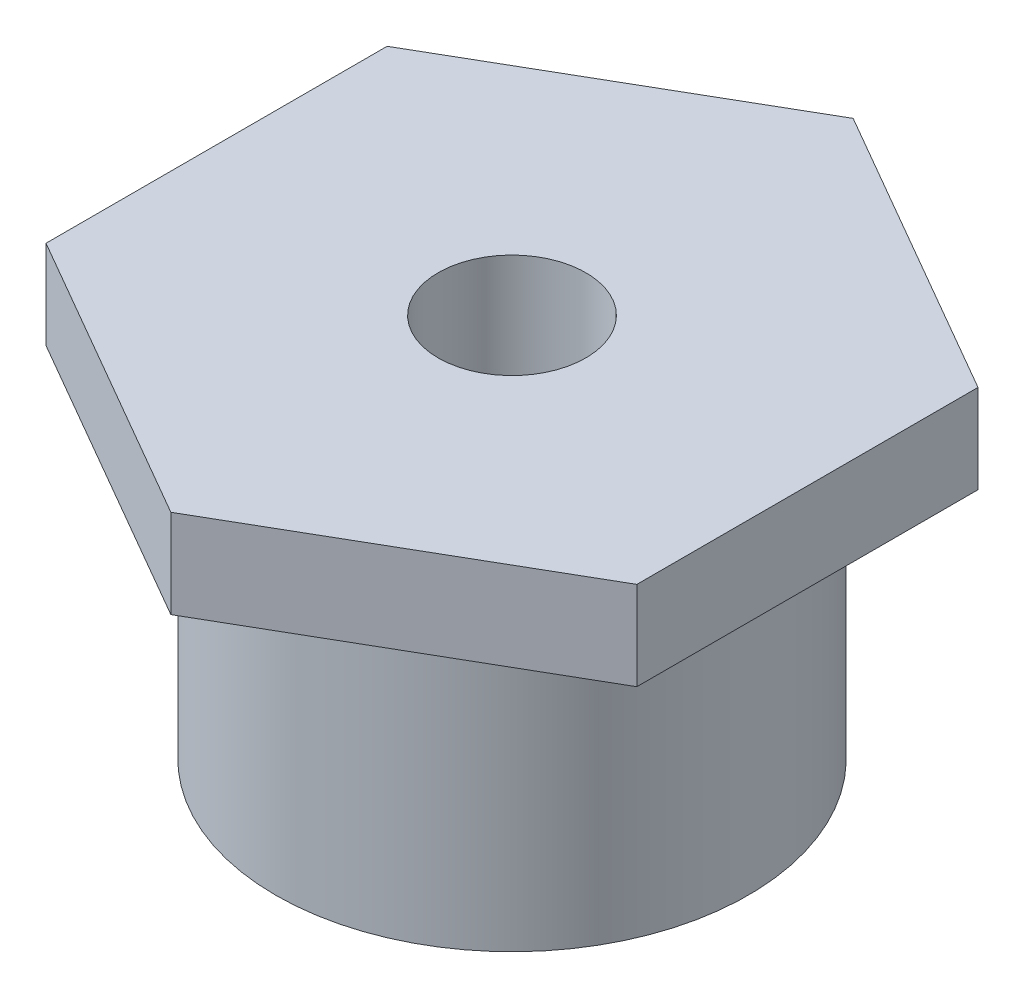
ISO-10303-21;
HEADER;
FILE_DESCRIPTION(('STEP AP214'),'2;1');
FILE_NAME('part.step','',(''),(''),'','','');
FILE_SCHEMA(('AUTOMOTIVE_DESIGN { 1 0 10303 214 1 1 1 1 }'));
ENDSEC;
DATA;
#1=APPLICATION_CONTEXT('core data for automotive mechanical design processes');
#2=APPLICATION_PROTOCOL_DEFINITION('international standard','automotive_design',2000,#1);
#3=PRODUCT_CONTEXT('',#1,'mechanical');
#4=PRODUCT('Part','Part','',(#3));
#5=PRODUCT_RELATED_PRODUCT_CATEGORY('part','',(#4));
#6=PRODUCT_DEFINITION_FORMATION('','',#4);
#7=PRODUCT_DEFINITION_CONTEXT('part definition',#1,'design');
#8=PRODUCT_DEFINITION('design','',#6,#7);
#9=PRODUCT_DEFINITION_SHAPE('','',#8);
#10=(LENGTH_UNIT() NAMED_UNIT(*) SI_UNIT(.MILLI.,.METRE.));
#11=(NAMED_UNIT(*) PLANE_ANGLE_UNIT() SI_UNIT($,.RADIAN.));
#12=(NAMED_UNIT(*) SI_UNIT($,.STERADIAN.) SOLID_ANGLE_UNIT());
#13=UNCERTAINTY_MEASURE_WITH_UNIT(LENGTH_MEASURE(1.E-05),#10,'distance_accuracy_value','');
#14=(GEOMETRIC_REPRESENTATION_CONTEXT(3) GLOBAL_UNCERTAINTY_ASSIGNED_CONTEXT((#13)) GLOBAL_UNIT_ASSIGNED_CONTEXT((#10,
#11,#12)) REPRESENTATION_CONTEXT('',''));
#15=CARTESIAN_POINT('',(0.,0.,0.));
#16=DIRECTION('',(0.,0.,1.));
#17=DIRECTION('',(1.,0.,0.));
#18=AXIS2_PLACEMENT_3D('',#15,#16,#17);
#19=CARTESIAN_POINT('',(0.,50.,0.));
#20=DIRECTION('',(0.,-1.,0.));
#21=DIRECTION('',(0.,0.,-1.));
#22=AXIS2_PLACEMENT_3D('',#19,#20,#21);
#23=CYLINDRICAL_SURFACE('',#22,40.);
#24=CARTESIAN_POINT('',(0.,50.,0.));
#25=DIRECTION('',(0.,1.,0.));
#26=DIRECTION('',(0.,0.,1.));
#27=AXIS2_PLACEMENT_3D('',#24,#25,#26);
#28=CIRCLE('',#27,40.);
#29=CARTESIAN_POINT('',(0.,50.,40.));
#30=VERTEX_POINT('',#29);
#31=EDGE_CURVE('E11',#30,#30,#28,.T.);
#32=ORIENTED_EDGE('',*,*,#31,.F.);
#33=EDGE_LOOP('',(#32));
#34=FACE_BOUND('',#33,.T.);
#35=CARTESIAN_POINT('',(0.,0.,0.));
#36=DIRECTION('',(0.,1.,0.));
#37=DIRECTION('',(0.,0.,1.));
#38=AXIS2_PLACEMENT_3D('',#35,#36,#37);
#39=CIRCLE('',#38,40.);
#40=CARTESIAN_POINT('',(0.,0.,40.));
#41=VERTEX_POINT('',#40);
#42=EDGE_CURVE('E37',#41,#41,#39,.T.);
#43=ORIENTED_EDGE('',*,*,#42,.T.);
#44=EDGE_LOOP('',(#43));
#45=FACE_BOUND('',#44,.T.);
#46=ADVANCED_FACE('F34',(#34,#45),#23,.T.);
#47=CARTESIAN_POINT('',(0.,0.,0.));
#48=DIRECTION('',(0.,1.,0.));
#49=DIRECTION('',(0.,0.,1.));
#50=AXIS2_PLACEMENT_3D('',#47,#48,#49);
#51=PLANE('',#50);
#52=ORIENTED_EDGE('',*,*,#42,.F.);
#53=EDGE_LOOP('',(#52));
#54=FACE_BOUND('',#53,.T.);
#55=ADVANCED_FACE('F143',(#54),#51,.F.);
#56=CARTESIAN_POINT('',(-50.,65.,28.8675134594813));
#57=DIRECTION('',(0.5,0.,-0.866025403784438));
#58=DIRECTION('',(-0.866025403784439,0.,-0.5));
#59=AXIS2_PLACEMENT_3D('',#56,#57,#58);
#60=PLANE('',#59);
#61=DIRECTION('',(0.866025403784438,0.,0.5));
#62=VECTOR('',#61,1.);
#63=CARTESIAN_POINT('',(-50.,50.,28.8675134594813));
#64=LINE('',#63,#62);
#65=CARTESIAN_POINT('',(-50.,50.,28.8675134594813));
#66=VERTEX_POINT('',#65);
#67=CARTESIAN_POINT('',(0.,50.,57.7350269189626));
#68=VERTEX_POINT('',#67);
#69=EDGE_CURVE('E119',#66,#68,#64,.T.);
#70=ORIENTED_EDGE('',*,*,#69,.T.);
#71=DIRECTION('',(0.,-1.,0.));
#72=VECTOR('',#71,1.);
#73=CARTESIAN_POINT('',(0.,65.,57.7350269189626));
#74=LINE('',#73,#72);
#75=CARTESIAN_POINT('',(0.,65.,57.7350269189626));
#76=VERTEX_POINT('',#75);
#77=EDGE_CURVE('E137',#76,#68,#74,.T.);
#78=ORIENTED_EDGE('',*,*,#77,.F.);
#79=DIRECTION('',(0.866025403784438,0.,0.5));
#80=VECTOR('',#79,1.);
#81=CARTESIAN_POINT('',(-50.,65.,28.8675134594813));
#82=LINE('',#81,#80);
#83=CARTESIAN_POINT('',(-50.,65.,28.8675134594813));
#84=VERTEX_POINT('',#83);
#85=EDGE_CURVE('E130',#84,#76,#82,.T.);
#86=ORIENTED_EDGE('',*,*,#85,.F.);
#87=DIRECTION('',(0.,-1.,0.));
#88=VECTOR('',#87,1.);
#89=CARTESIAN_POINT('',(-50.,65.,28.8675134594813));
#90=LINE('',#89,#88);
#91=EDGE_CURVE('E115',#84,#66,#90,.T.);
#92=ORIENTED_EDGE('',*,*,#91,.T.);
#93=EDGE_LOOP('',(#70,#78,#86,#92));
#94=FACE_BOUND('',#93,.T.);
#95=ADVANCED_FACE('F145',(#94),#60,.F.);
#96=CARTESIAN_POINT('',(0.,65.,57.7350269189626));
#97=DIRECTION('',(-0.5,0.,-0.866025403784439));
#98=DIRECTION('',(-0.866025403784439,0.,0.5));
#99=AXIS2_PLACEMENT_3D('',#96,#97,#98);
#100=PLANE('',#99);
#101=DIRECTION('',(0.866025403784439,0.,-0.5));
#102=VECTOR('',#101,1.);
#103=CARTESIAN_POINT('',(0.,50.,57.7350269189626));
#104=LINE('',#103,#102);
#105=CARTESIAN_POINT('',(50.,50.,28.8675134594813));
#106=VERTEX_POINT('',#105);
#107=EDGE_CURVE('E122',#68,#106,#104,.T.);
#108=ORIENTED_EDGE('',*,*,#107,.T.);
#109=DIRECTION('',(0.,-1.,0.));
#110=VECTOR('',#109,1.);
#111=CARTESIAN_POINT('',(50.,65.,28.8675134594813));
#112=LINE('',#111,#110);
#113=CARTESIAN_POINT('',(50.,65.,28.8675134594813));
#114=VERTEX_POINT('',#113);
#115=EDGE_CURVE('E134',#114,#106,#112,.T.);
#116=ORIENTED_EDGE('',*,*,#115,.F.);
#117=DIRECTION('',(0.866025403784439,0.,-0.5));
#118=VECTOR('',#117,1.);
#119=CARTESIAN_POINT('',(0.,65.,57.7350269189626));
#120=LINE('',#119,#118);
#121=EDGE_CURVE('E88',#76,#114,#120,.T.);
#122=ORIENTED_EDGE('',*,*,#121,.F.);
#123=ORIENTED_EDGE('',*,*,#77,.T.);
#124=EDGE_LOOP('',(#108,#116,#122,#123));
#125=FACE_BOUND('',#124,.T.);
#126=ADVANCED_FACE('F150',(#125),#100,.F.);
#127=CARTESIAN_POINT('',(50.,65.,28.8675134594813));
#128=DIRECTION('',(-1.,0.,0.));
#129=DIRECTION('',(0.,0.,1.));
#130=AXIS2_PLACEMENT_3D('',#127,#128,#129);
#131=PLANE('',#130);
#132=DIRECTION('',(0.,0.,-1.));
#133=VECTOR('',#132,1.);
#134=CARTESIAN_POINT('',(50.,50.,28.8675134594813));
#135=LINE('',#134,#133);
#136=CARTESIAN_POINT('',(50.,50.,-28.8675134594813));
#137=VERTEX_POINT('',#136);
#138=EDGE_CURVE('E125',#106,#137,#135,.T.);
#139=ORIENTED_EDGE('',*,*,#138,.T.);
#140=DIRECTION('',(0.,-1.,0.));
#141=VECTOR('',#140,1.);
#142=CARTESIAN_POINT('',(50.,65.,-28.8675134594813));
#143=LINE('',#142,#141);
#144=CARTESIAN_POINT('',(50.,65.,-28.8675134594813));
#145=VERTEX_POINT('',#144);
#146=EDGE_CURVE('E110',#145,#137,#143,.T.);
#147=ORIENTED_EDGE('',*,*,#146,.F.);
#148=DIRECTION('',(0.,0.,-1.));
#149=VECTOR('',#148,1.);
#150=CARTESIAN_POINT('',(50.,65.,28.8675134594813));
#151=LINE('',#150,#149);
#152=EDGE_CURVE('E101',#114,#145,#151,.T.);
#153=ORIENTED_EDGE('',*,*,#152,.F.);
#154=ORIENTED_EDGE('',*,*,#115,.T.);
#155=EDGE_LOOP('',(#139,#147,#153,#154));
#156=FACE_BOUND('',#155,.T.);
#157=ADVANCED_FACE('F157',(#156),#131,.F.);
#158=CARTESIAN_POINT('',(50.,65.,-28.8675134594813));
#159=DIRECTION('',(-0.5,0.,0.866025403784439));
#160=DIRECTION('',(0.866025403784439,0.,0.5));
#161=AXIS2_PLACEMENT_3D('',#158,#159,#160);
#162=PLANE('',#161);
#163=DIRECTION('',(-0.866025403784439,0.,-0.5));
#164=VECTOR('',#163,1.);
#165=CARTESIAN_POINT('',(50.,50.,-28.8675134594813));
#166=LINE('',#165,#164);
#167=CARTESIAN_POINT('',(0.,50.,-57.7350269189626));
#168=VERTEX_POINT('',#167);
#169=EDGE_CURVE('E109',#137,#168,#166,.T.);
#170=ORIENTED_EDGE('',*,*,#169,.T.);
#171=DIRECTION('',(0.,-1.,0.));
#172=VECTOR('',#171,1.);
#173=CARTESIAN_POINT('',(0.,65.,-57.7350269189626));
#174=LINE('',#173,#172);
#175=CARTESIAN_POINT('',(0.,65.,-57.7350269189626));
#176=VERTEX_POINT('',#175);
#177=EDGE_CURVE('E106',#176,#168,#174,.T.);
#178=ORIENTED_EDGE('',*,*,#177,.F.);
#179=DIRECTION('',(-0.866025403784439,0.,-0.5));
#180=VECTOR('',#179,1.);
#181=CARTESIAN_POINT('',(50.,65.,-28.8675134594813));
#182=LINE('',#181,#180);
#183=EDGE_CURVE('E95',#145,#176,#182,.T.);
#184=ORIENTED_EDGE('',*,*,#183,.F.);
#185=ORIENTED_EDGE('',*,*,#146,.T.);
#186=EDGE_LOOP('',(#170,#178,#184,#185));
#187=FACE_BOUND('',#186,.T.);
#188=ADVANCED_FACE('F107',(#187),#162,.F.);
#189=CARTESIAN_POINT('',(0.,65.,-57.7350269189626));
#190=DIRECTION('',(0.5,0.,0.866025403784439));
#191=DIRECTION('',(0.866025403784439,0.,-0.5));
#192=AXIS2_PLACEMENT_3D('',#189,#190,#191);
#193=PLANE('',#192);
#194=DIRECTION('',(-0.866025403784439,0.,0.5));
#195=VECTOR('',#194,1.);
#196=CARTESIAN_POINT('',(0.,50.,-57.7350269189626));
#197=LINE('',#196,#195);
#198=CARTESIAN_POINT('',(-50.,50.,-28.8675134594813));
#199=VERTEX_POINT('',#198);
#200=EDGE_CURVE('E73',#168,#199,#197,.T.);
#201=ORIENTED_EDGE('',*,*,#200,.T.);
#202=DIRECTION('',(0.,-1.,0.));
#203=VECTOR('',#202,1.);
#204=CARTESIAN_POINT('',(-50.,65.,-28.8675134594813));
#205=LINE('',#204,#203);
#206=CARTESIAN_POINT('',(-50.,65.,-28.8675134594813));
#207=VERTEX_POINT('',#206);
#208=EDGE_CURVE('E111',#207,#199,#205,.T.);
#209=ORIENTED_EDGE('',*,*,#208,.F.);
#210=DIRECTION('',(-0.866025403784439,0.,0.5));
#211=VECTOR('',#210,1.);
#212=CARTESIAN_POINT('',(0.,65.,-57.7350269189626));
#213=LINE('',#212,#211);
#214=EDGE_CURVE('E99',#176,#207,#213,.T.);
#215=ORIENTED_EDGE('',*,*,#214,.F.);
#216=ORIENTED_EDGE('',*,*,#177,.T.);
#217=EDGE_LOOP('',(#201,#209,#215,#216));
#218=FACE_BOUND('',#217,.T.);
#219=ADVANCED_FACE('F113',(#218),#193,.F.);
#220=CARTESIAN_POINT('',(-50.,65.,-28.8675134594813));
#221=DIRECTION('',(1.,0.,0.));
#222=DIRECTION('',(0.,0.,-1.));
#223=AXIS2_PLACEMENT_3D('',#220,#221,#222);
#224=PLANE('',#223);
#225=DIRECTION('',(0.,0.,1.));
#226=VECTOR('',#225,1.);
#227=CARTESIAN_POINT('',(-50.,50.,-28.8675134594813));
#228=LINE('',#227,#226);
#229=EDGE_CURVE('E79',#199,#66,#228,.T.);
#230=ORIENTED_EDGE('',*,*,#229,.T.);
#231=ORIENTED_EDGE('',*,*,#91,.F.);
#232=DIRECTION('',(0.,0.,1.));
#233=VECTOR('',#232,1.);
#234=CARTESIAN_POINT('',(-50.,65.,-28.8675134594813));
#235=LINE('',#234,#233);
#236=EDGE_CURVE('E50',#207,#84,#235,.T.);
#237=ORIENTED_EDGE('',*,*,#236,.F.);
#238=ORIENTED_EDGE('',*,*,#208,.T.);
#239=EDGE_LOOP('',(#230,#231,#237,#238));
#240=FACE_BOUND('',#239,.T.);
#241=ADVANCED_FACE('F165',(#240),#224,.F.);
#242=CARTESIAN_POINT('',(0.,65.,0.));
#243=DIRECTION('',(0.,1.,0.));
#244=DIRECTION('',(0.,0.,1.));
#245=AXIS2_PLACEMENT_3D('',#242,#243,#244);
#246=PLANE('',#245);
#247=CARTESIAN_POINT('',(0.,65.,0.));
#248=DIRECTION('',(0.,1.,0.));
#249=DIRECTION('',(0.,0.,1.));
#250=AXIS2_PLACEMENT_3D('',#247,#248,#249);
#251=CIRCLE('',#250,12.5);
#252=CARTESIAN_POINT('',(0.,65.,12.5));
#253=VERTEX_POINT('',#252);
#254=EDGE_CURVE('E186',#253,#253,#251,.T.);
#255=ORIENTED_EDGE('',*,*,#254,.F.);
#256=EDGE_LOOP('',(#255));
#257=FACE_BOUND('',#256,.T.);
#258=ORIENTED_EDGE('',*,*,#85,.T.);
#259=ORIENTED_EDGE('',*,*,#121,.T.);
#260=ORIENTED_EDGE('',*,*,#152,.T.);
#261=ORIENTED_EDGE('',*,*,#183,.T.);
#262=ORIENTED_EDGE('',*,*,#214,.T.);
#263=ORIENTED_EDGE('',*,*,#236,.T.);
#264=EDGE_LOOP('',(#258,#259,#260,#261,#262,#263));
#265=FACE_BOUND('',#264,.T.);
#266=ADVANCED_FACE('F97',(#257,#265),#246,.T.);
#267=CARTESIAN_POINT('',(0.,50.,0.));
#268=DIRECTION('',(0.,1.,0.));
#269=DIRECTION('',(0.,0.,1.));
#270=AXIS2_PLACEMENT_3D('',#267,#268,#269);
#271=PLANE('',#270);
#272=ORIENTED_EDGE('',*,*,#31,.T.);
#273=EDGE_LOOP('',(#272));
#274=FACE_BOUND('',#273,.T.);
#275=ORIENTED_EDGE('',*,*,#69,.F.);
#276=ORIENTED_EDGE('',*,*,#229,.F.);
#277=ORIENTED_EDGE('',*,*,#200,.F.);
#278=ORIENTED_EDGE('',*,*,#169,.F.);
#279=ORIENTED_EDGE('',*,*,#138,.F.);
#280=ORIENTED_EDGE('',*,*,#107,.F.);
#281=EDGE_LOOP('',(#275,#276,#277,#278,#279,#280));
#282=FACE_BOUND('',#281,.T.);
#283=ADVANCED_FACE('F168',(#274,#282),#271,.F.);
#284=CARTESIAN_POINT('',(0.,30.,0.));
#285=DIRECTION('',(0.,1.,0.));
#286=DIRECTION('',(0.,0.,1.));
#287=AXIS2_PLACEMENT_3D('',#284,#285,#286);
#288=CYLINDRICAL_SURFACE('',#287,12.5);
#289=CARTESIAN_POINT('',(0.,30.,0.));
#290=DIRECTION('',(0.,1.,0.));
#291=DIRECTION('',(0.,0.,1.));
#292=AXIS2_PLACEMENT_3D('',#289,#290,#291);
#293=CIRCLE('',#292,12.5);
#294=CARTESIAN_POINT('',(0.,30.,12.5));
#295=VERTEX_POINT('',#294);
#296=EDGE_CURVE('E123',#295,#295,#293,.T.);
#297=ORIENTED_EDGE('',*,*,#296,.F.);
#298=EDGE_LOOP('',(#297));
#299=FACE_BOUND('',#298,.T.);
#300=ORIENTED_EDGE('',*,*,#254,.T.);
#301=EDGE_LOOP('',(#300));
#302=FACE_BOUND('',#301,.T.);
#303=ADVANCED_FACE('F171',(#299,#302),#288,.F.);
#304=CARTESIAN_POINT('',(0.,30.,0.));
#305=DIRECTION('',(0.,1.,0.));
#306=DIRECTION('',(0.,0.,1.));
#307=AXIS2_PLACEMENT_3D('',#304,#305,#306);
#308=PLANE('',#307);
#309=ORIENTED_EDGE('',*,*,#296,.T.);
#310=EDGE_LOOP('',(#309));
#311=FACE_BOUND('',#310,.T.);
#312=ADVANCED_FACE('F178',(#311),#308,.T.);
#313=CLOSED_SHELL('',(#46,#55,#95,#126,#157,#188,#219,#241,#266,#283,#303,#312));
#314=MANIFOLD_SOLID_BREP('B2',#313);
#315=ADVANCED_BREP_SHAPE_REPRESENTATION('',(#18,#314),#14);
#316=SHAPE_DEFINITION_REPRESENTATION(#9,#315);
ENDSEC;
END-ISO-10303-21;
